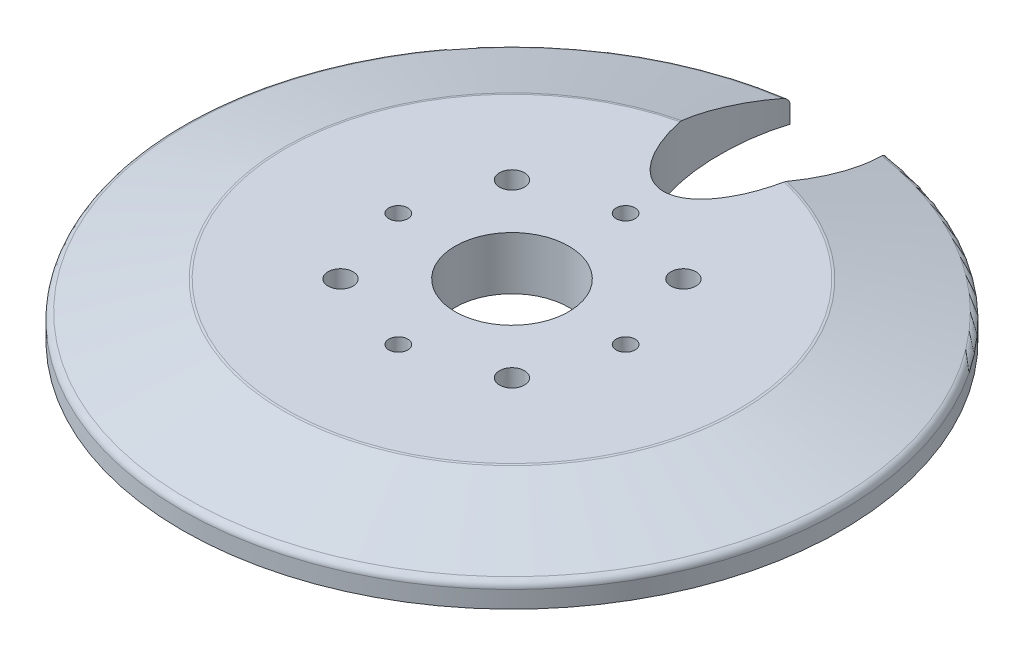
ISO-10303-21;
HEADER;
FILE_DESCRIPTION(('STEP AP214'),'2;1');
FILE_NAME('part.step','',(''),(''),'','','');
FILE_SCHEMA(('AUTOMOTIVE_DESIGN { 1 0 10303 214 1 1 1 1 }'));
ENDSEC;
DATA;
#1=APPLICATION_CONTEXT('core data for automotive mechanical design processes');
#2=APPLICATION_PROTOCOL_DEFINITION('international standard','automotive_design',2000,#1);
#3=PRODUCT_CONTEXT('',#1,'mechanical');
#4=PRODUCT('Part','Part','',(#3));
#5=PRODUCT_RELATED_PRODUCT_CATEGORY('part','',(#4));
#6=PRODUCT_DEFINITION_FORMATION('','',#4);
#7=PRODUCT_DEFINITION_CONTEXT('part definition',#1,'design');
#8=PRODUCT_DEFINITION('design','',#6,#7);
#9=PRODUCT_DEFINITION_SHAPE('','',#8);
#10=(LENGTH_UNIT() NAMED_UNIT(*) SI_UNIT(.MILLI.,.METRE.));
#11=(NAMED_UNIT(*) PLANE_ANGLE_UNIT() SI_UNIT($,.RADIAN.));
#12=(NAMED_UNIT(*) SI_UNIT($,.STERADIAN.) SOLID_ANGLE_UNIT());
#13=UNCERTAINTY_MEASURE_WITH_UNIT(LENGTH_MEASURE(1.E-05),#10,'distance_accuracy_value','');
#14=(GEOMETRIC_REPRESENTATION_CONTEXT(3) GLOBAL_UNCERTAINTY_ASSIGNED_CONTEXT((#13)) GLOBAL_UNIT_ASSIGNED_CONTEXT((#10,
#11,#12)) REPRESENTATION_CONTEXT('',''));
#15=CARTESIAN_POINT('',(0.,0.,0.));
#16=DIRECTION('',(0.,0.,1.));
#17=DIRECTION('',(1.,0.,0.));
#18=AXIS2_PLACEMENT_3D('',#15,#16,#17);
#19=CARTESIAN_POINT('',(0.,0.,0.));
#20=DIRECTION('',(0.,-1.,0.));
#21=DIRECTION('',(1.,0.,0.));
#22=AXIS2_PLACEMENT_3D('',#19,#20,#21);
#23=PLANE('',#22);
#24=CARTESIAN_POINT('',(-11.3137084989847,0.,-11.3137084989848));
#25=DIRECTION('',(0.,1.,0.));
#26=DIRECTION('',(0.,0.,1.));
#27=AXIS2_PLACEMENT_3D('',#24,#25,#26);
#28=CIRCLE('',#27,1.65);
#29=CARTESIAN_POINT('',(-11.3137084989847,0.,-9.66370849898478));
#30=VERTEX_POINT('',#29);
#31=EDGE_CURVE('E380',#30,#30,#28,.T.);
#32=ORIENTED_EDGE('',*,*,#31,.T.);
#33=EDGE_LOOP('',(#32));
#34=FACE_BOUND('',#33,.T.);
#35=CARTESIAN_POINT('',(11.3137084989848,0.,-11.3137084989847));
#36=DIRECTION('',(0.,1.,0.));
#37=DIRECTION('',(0.,0.,1.));
#38=AXIS2_PLACEMENT_3D('',#35,#36,#37);
#39=CIRCLE('',#38,1.65);
#40=CARTESIAN_POINT('',(11.3137084989848,0.,-9.6637084989847));
#41=VERTEX_POINT('',#40);
#42=EDGE_CURVE('E374',#41,#41,#39,.T.);
#43=ORIENTED_EDGE('',*,*,#42,.T.);
#44=EDGE_LOOP('',(#43));
#45=FACE_BOUND('',#44,.T.);
#46=CARTESIAN_POINT('',(11.3137084989847,0.,11.3137084989848));
#47=DIRECTION('',(0.,1.,0.));
#48=DIRECTION('',(0.,0.,1.));
#49=AXIS2_PLACEMENT_3D('',#46,#47,#48);
#50=CIRCLE('',#49,1.65);
#51=CARTESIAN_POINT('',(11.3137084989847,0.,12.9637084989848));
#52=VERTEX_POINT('',#51);
#53=EDGE_CURVE('E368',#52,#52,#50,.T.);
#54=ORIENTED_EDGE('',*,*,#53,.T.);
#55=EDGE_LOOP('',(#54));
#56=FACE_BOUND('',#55,.T.);
#57=CARTESIAN_POINT('',(-11.3137084989849,0.,11.3137084989846));
#58=DIRECTION('',(0.,1.,0.));
#59=DIRECTION('',(0.,0.,1.));
#60=AXIS2_PLACEMENT_3D('',#57,#58,#59);
#61=CIRCLE('',#60,1.65);
#62=CARTESIAN_POINT('',(-11.3137084989849,0.,12.9637084989846));
#63=VERTEX_POINT('',#62);
#64=EDGE_CURVE('E362',#63,#63,#61,.T.);
#65=ORIENTED_EDGE('',*,*,#64,.T.);
#66=EDGE_LOOP('',(#65));
#67=FACE_BOUND('',#66,.T.);
#68=CARTESIAN_POINT('',(0.,0.,-15.));
#69=DIRECTION('',(0.,1.,0.));
#70=DIRECTION('',(0.,0.,1.));
#71=AXIS2_PLACEMENT_3D('',#68,#69,#70);
#72=CIRCLE('',#71,1.25);
#73=CARTESIAN_POINT('',(0.,0.,-13.75));
#74=VERTEX_POINT('',#73);
#75=EDGE_CURVE('E356',#74,#74,#72,.T.);
#76=ORIENTED_EDGE('',*,*,#75,.T.);
#77=EDGE_LOOP('',(#76));
#78=FACE_BOUND('',#77,.T.);
#79=CARTESIAN_POINT('',(-15.,0.,0.));
#80=DIRECTION('',(0.,1.,0.));
#81=DIRECTION('',(0.,0.,1.));
#82=AXIS2_PLACEMENT_3D('',#79,#80,#81);
#83=CIRCLE('',#82,1.25);
#84=CARTESIAN_POINT('',(-15.,0.,1.25));
#85=VERTEX_POINT('',#84);
#86=EDGE_CURVE('E350',#85,#85,#83,.T.);
#87=ORIENTED_EDGE('',*,*,#86,.T.);
#88=EDGE_LOOP('',(#87));
#89=FACE_BOUND('',#88,.T.);
#90=CARTESIAN_POINT('',(0.,0.,15.));
#91=DIRECTION('',(0.,1.,0.));
#92=DIRECTION('',(0.,0.,1.));
#93=AXIS2_PLACEMENT_3D('',#90,#91,#92);
#94=CIRCLE('',#93,1.25);
#95=CARTESIAN_POINT('',(0.,0.,16.25));
#96=VERTEX_POINT('',#95);
#97=EDGE_CURVE('E343',#96,#96,#94,.T.);
#98=ORIENTED_EDGE('',*,*,#97,.T.);
#99=EDGE_LOOP('',(#98));
#100=FACE_BOUND('',#99,.T.);
#101=CARTESIAN_POINT('',(15.,0.,0.));
#102=DIRECTION('',(0.,1.,0.));
#103=DIRECTION('',(0.,0.,1.));
#104=AXIS2_PLACEMENT_3D('',#101,#102,#103);
#105=CIRCLE('',#104,1.25);
#106=CARTESIAN_POINT('',(15.,0.,1.25));
#107=VERTEX_POINT('',#106);
#108=EDGE_CURVE('E139',#107,#107,#105,.T.);
#109=ORIENTED_EDGE('',*,*,#108,.T.);
#110=EDGE_LOOP('',(#109));
#111=FACE_BOUND('',#110,.T.);
#112=CARTESIAN_POINT('',(0.,0.,-35.));
#113=DIRECTION('',(0.,1.,0.));
#114=DIRECTION('',(0.,0.,-1.));
#115=AXIS2_PLACEMENT_3D('',#112,#113,#114);
#116=ELLIPSE('',#115,15.,7.5);
#117=CARTESIAN_POINT('',(-6.33272240623717,0.,-43.0365731317625));
#118=VERTEX_POINT('',#117);
#119=CARTESIAN_POINT('',(6.33272240623717,0.,-43.0365731317625));
#120=VERTEX_POINT('',#119);
#121=EDGE_CURVE('E86',#118,#120,#116,.T.);
#122=ORIENTED_EDGE('',*,*,#121,.T.);
#123=CARTESIAN_POINT('',(0.,0.,0.));
#124=DIRECTION('',(0.,1.,0.));
#125=DIRECTION('',(-1.,0.,0.));
#126=AXIS2_PLACEMENT_3D('',#123,#124,#125);
#127=CIRCLE('',#126,43.5);
#128=EDGE_CURVE('E101',#118,#120,#127,.T.);
#129=ORIENTED_EDGE('',*,*,#128,.F.);
#130=EDGE_LOOP('',(#122,#129));
#131=FACE_BOUND('',#130,.T.);
#132=CARTESIAN_POINT('',(0.,0.,0.));
#133=DIRECTION('',(0.,1.,0.));
#134=DIRECTION('',(-1.,0.,0.));
#135=AXIS2_PLACEMENT_3D('',#132,#133,#134);
#136=CIRCLE('',#135,7.5);
#137=CARTESIAN_POINT('',(-7.5,0.,0.));
#138=VERTEX_POINT('',#137);
#139=EDGE_CURVE('E106',#138,#138,#136,.T.);
#140=ORIENTED_EDGE('',*,*,#139,.T.);
#141=EDGE_LOOP('',(#140));
#142=FACE_BOUND('',#141,.T.);
#143=ADVANCED_FACE('F38',(#34,#45,#56,#67,#78,#89,#100,#111,#131,#142),#23,.T.);
#144=CARTESIAN_POINT('',(0.,7.,0.));
#145=DIRECTION('',(0.,1.,0.));
#146=DIRECTION('',(-1.,0.,0.));
#147=AXIS2_PLACEMENT_3D('',#144,#145,#146);
#148=CYLINDRICAL_SURFACE('',#147,43.5);
#149=DIRECTION('',(0.,1.,0.));
#150=VECTOR('',#149,1.);
#151=CARTESIAN_POINT('',(6.33272240623717,0.,-43.0365731317625));
#152=LINE('',#151,#150);
#153=CARTESIAN_POINT('',(6.33272240623717,2.25332386367935,-43.0365731317625));
#154=VERTEX_POINT('',#153);
#155=EDGE_CURVE('E92',#154,#120,#152,.F.);
#156=ORIENTED_EDGE('',*,*,#155,.F.);
#157=CARTESIAN_POINT('',(0.,2.25332386367935,0.));
#158=DIRECTION('',(0.,-1.,0.));
#159=DIRECTION('',(1.,0.,0.));
#160=AXIS2_PLACEMENT_3D('',#157,#158,#159);
#161=CIRCLE('',#160,43.5);
#162=CARTESIAN_POINT('',(-6.33272240623717,2.25332386367935,-43.0365731317625));
#163=VERTEX_POINT('',#162);
#164=EDGE_CURVE('E11',#154,#163,#161,.T.);
#165=ORIENTED_EDGE('',*,*,#164,.T.);
#166=DIRECTION('',(0.,1.,0.));
#167=VECTOR('',#166,1.);
#168=CARTESIAN_POINT('',(-6.33272240623717,0.,-43.0365731317625));
#169=LINE('',#168,#167);
#170=EDGE_CURVE('E89',#118,#163,#169,.T.);
#171=ORIENTED_EDGE('',*,*,#170,.F.);
#172=ORIENTED_EDGE('',*,*,#128,.T.);
#173=EDGE_LOOP('',(#156,#165,#171,#172));
#174=FACE_BOUND('',#173,.T.);
#175=ADVANCED_FACE('F100',(#174),#148,.T.);
#176=CARTESIAN_POINT('',(0.,7.,0.));
#177=DIRECTION('',(0.,-1.,0.));
#178=DIRECTION('',(1.,0.,0.));
#179=AXIS2_PLACEMENT_3D('',#176,#177,#178);
#180=CONICAL_SURFACE('',#179,30.,1.28274087974427);
#181=CARTESIAN_POINT('',(6.91500357910958,7.,-29.1921689071042));
#182=CARTESIAN_POINT('',(6.99058252573705,6.89099283311108,-29.5523374989682));
#183=CARTESIAN_POINT('',(7.05832220949969,6.78205504266193,-29.9141349558623));
#184=CARTESIAN_POINT('',(7.17879527505233,6.56442602993237,-30.6403400157221));
#185=CARTESIAN_POINT('',(7.23152712439722,6.45573483395494,-31.0047478813439));
#186=CARTESIAN_POINT('',(7.32274027758913,6.23849407906337,-31.7362438260214));
#187=CARTESIAN_POINT('',(7.36119046320098,6.12994533704189,-32.103336001096));
#188=CARTESIAN_POINT('',(7.42409646655395,5.91330605808753,-32.8388817154343));
#189=CARTESIAN_POINT('',(7.44855110400736,5.80521556056259,-33.2073353668791));
#190=CARTESIAN_POINT('',(7.4837282666558,5.58954301157494,-33.9451865912305));
#191=CARTESIAN_POINT('',(7.49444598352582,5.48196115127079,-34.3145844493286));
#192=CARTESIAN_POINT('',(7.50222820836339,5.26741898212897,-35.0537093486207));
#193=CARTESIAN_POINT('',(7.49929214367075,5.1604586995496,-35.4234364029714));
#194=CARTESIAN_POINT('',(7.47346124470894,4.87895397970797,-36.3994969791757));
#195=CARTESIAN_POINT('',(7.43898934012312,4.70499260599332,-37.0057297173065));
#196=CARTESIAN_POINT('',(7.33211184178528,4.35944435080625,-38.2152165041845));
#197=CARTESIAN_POINT('',(7.25972761745695,4.18785618753007,-38.8184720378876));
#198=CARTESIAN_POINT('',(7.12008124714593,3.93117242596224,-39.7243714934751));
#199=CARTESIAN_POINT('',(7.06778068651763,3.84500804310769,-40.0290669225639));
#200=CARTESIAN_POINT('',(6.95223546193924,3.67351754913976,-40.6366064638285));
#201=CARTESIAN_POINT('',(6.8889915415212,3.58819138149091,-40.9394507003349));
#202=CARTESIAN_POINT('',(6.75088477541508,3.41839348516313,-41.543141048671));
#203=CARTESIAN_POINT('',(6.67600820260414,3.33392289318979,-41.8439843562068));
#204=CARTESIAN_POINT('',(6.51386216188534,3.16608619887389,-42.4426975121095));
#205=CARTESIAN_POINT('',(6.42658982091376,3.08272035749922,-42.740566653952));
#206=CARTESIAN_POINT('',(6.33272240623717,2.99999999999999,-43.0365731317625));
#207=B_SPLINE_CURVE_WITH_KNOTS('',3,(#181,#182,#183,#184,#185,#186,#187,#188,#189,#190,#191,
#192,#193,#194,#195,#196,#197,#198,#199,#200,#201,#202,#203,#204,#205,#206),.UNSPECIFIED.,.F.,
.F.,(4,2,2,2,2,2,2,2,2,2,2,2,4),(0.,1.15131888629253,2.30275529123953,3.45668603819832,
4.61071408535835,5.76514596595646,6.91962626560541,8.81340653585426,10.7061205165359,
11.668764326529,12.6313427566303,13.5950658292911,14.559012637163),.UNSPECIFIED.);
#208=CARTESIAN_POINT('',(6.94321339547094,6.95879811270839,-29.3283907945089));
#209=VERTEX_POINT('',#208);
#210=CARTESIAN_POINT('',(6.55788256942399,3.21212197638773,-42.2785097940843));
#211=VERTEX_POINT('',#210);
#212=EDGE_CURVE('E102',#209,#211,#207,.T.);
#213=ORIENTED_EDGE('',*,*,#212,.F.);
#214=CARTESIAN_POINT('',(0.,6.95879811270839,0.));
#215=DIRECTION('',(0.,1.,0.));
#216=DIRECTION('',(-1.,0.,0.));
#217=AXIS2_PLACEMENT_3D('',#214,#215,#216);
#218=CIRCLE('',#217,30.1390563696092);
#219=CARTESIAN_POINT('',(-6.94321339547094,6.95879811270839,-29.3283907945089));
#220=VERTEX_POINT('',#219);
#221=EDGE_CURVE('E47',#209,#220,#218,.F.);
#222=ORIENTED_EDGE('',*,*,#221,.T.);
#223=CARTESIAN_POINT('',(-6.33272240623717,2.99999999999999,-43.0365731317625));
#224=CARTESIAN_POINT('',(-6.41500963826579,3.07250474003001,-42.7771222068692));
#225=CARTESIAN_POINT('',(-6.4922183902949,3.14550824819237,-42.5162300383217));
#226=CARTESIAN_POINT('',(-6.63703185431277,3.29238350326354,-41.9920831626844));
#227=CARTESIAN_POINT('',(-6.70463820907837,3.36625509931295,-41.7288288679198));
#228=CARTESIAN_POINT('',(-6.83077906154359,3.51470502748615,-41.2005917470543));
#229=CARTESIAN_POINT('',(-6.88932049821938,3.58928277219832,-40.9356104065142));
#230=CARTESIAN_POINT('',(-6.99782566270411,3.73911487979075,-40.4040847401307));
#231=CARTESIAN_POINT('',(-7.04778895903325,3.81436927650632,-40.1375403363625));
#232=CARTESIAN_POINT('',(-7.18529740381263,4.04091747590818,-39.3364689220024));
#233=CARTESIAN_POINT('',(-7.26056724256861,4.19312301787461,-38.800052553725));
#234=CARTESIAN_POINT('',(-7.38041186706725,4.4995186820609,-37.7242805760132));
#235=CARTESIAN_POINT('',(-7.42497821436657,4.65370933801099,-37.1849241995758));
#236=CARTESIAN_POINT('',(-7.48453899730138,4.96367643654972,-36.1052408584844));
#237=CARTESIAN_POINT('',(-7.49954330617571,5.1194523322166,-35.5649142782289));
#238=CARTESIAN_POINT('',(-7.50043617800935,5.43236459982957,-34.4847031891015));
#239=CARTESIAN_POINT('',(-7.48632922062023,5.58950075875263,-33.9448186250011));
#240=CARTESIAN_POINT('',(-7.43860966826479,5.85078426938173,-33.0519327609483));
#241=CARTESIAN_POINT('',(-7.41335106375604,5.9546125671417,-32.6983718287059));
#242=CARTESIAN_POINT('',(-7.34989255637677,6.16269288852212,-31.9925273763884));
#243=CARTESIAN_POINT('',(-7.31169268836423,6.26694491100051,-31.6402438528751));
#244=CARTESIAN_POINT('',(-7.22194030171611,6.47586443492507,-30.9372196039325));
#245=CARTESIAN_POINT('',(-7.17037829609453,6.58053217932755,-30.5864801554503));
#246=CARTESIAN_POINT('',(-7.05330478479144,6.79011199480147,-29.8873790544799));
#247=CARTESIAN_POINT('',(-6.98779198783541,6.89502408759996,-29.5390176251819));
#248=CARTESIAN_POINT('',(-6.91500357910957,7.,-29.1921689071042));
#249=B_SPLINE_CURVE_WITH_KNOTS('',3,(#223,#224,#225,#226,#227,#228,#229,#230,#231,#232,#233,
#234,#235,#236,#237,#238,#239,#240,#241,#242,#243,#244,#245,#246,#247,#248),.UNSPECIFIED.,.F.,
.F.,(4,2,2,2,2,2,2,2,2,2,2,2,4),(0.,0.844945294848248,1.68974586200335,2.53389652337713,
3.37808963303341,5.06503674782468,6.75244731267445,8.43929421431119,10.1258815627279,
11.2337448023194,12.3416050578471,13.4502540485581,14.5590056996054),.UNSPECIFIED.);
#250=CARTESIAN_POINT('',(-6.55788256942399,3.21212197638773,-42.2785097940842));
#251=VERTEX_POINT('',#250);
#252=EDGE_CURVE('E96',#251,#220,#249,.T.);
#253=ORIENTED_EDGE('',*,*,#252,.F.);
#254=CARTESIAN_POINT('',(0.,3.21212197638774,0.));
#255=DIRECTION('',(0.,1.,0.));
#256=DIRECTION('',(-1.,0.,0.));
#257=AXIS2_PLACEMENT_3D('',#254,#255,#256);
#258=CIRCLE('',#257,42.7840883296914);
#259=EDGE_CURVE('E193',#251,#211,#258,.T.);
#260=ORIENTED_EDGE('',*,*,#259,.T.);
#261=EDGE_LOOP('',(#213,#222,#253,#260));
#262=FACE_BOUND('',#261,.T.);
#263=ADVANCED_FACE('F147',(#262),#180,.T.);
#264=CARTESIAN_POINT('',(-30.,7.,0.));
#265=DIRECTION('',(0.,1.,0.));
#266=DIRECTION('',(-1.,0.,0.));
#267=AXIS2_PLACEMENT_3D('',#264,#265,#266);
#268=PLANE('',#267);
#269=CARTESIAN_POINT('',(-11.3137084989847,7.,-11.3137084989848));
#270=DIRECTION('',(0.,1.,0.));
#271=DIRECTION('',(0.,0.,1.));
#272=AXIS2_PLACEMENT_3D('',#269,#270,#271);
#273=CIRCLE('',#272,1.64999999999999);
#274=CARTESIAN_POINT('',(-11.3137084989847,7.,-9.66370849898479));
#275=VERTEX_POINT('',#274);
#276=EDGE_CURVE('E382',#275,#275,#273,.T.);
#277=ORIENTED_EDGE('',*,*,#276,.F.);
#278=EDGE_LOOP('',(#277));
#279=FACE_BOUND('',#278,.T.);
#280=CARTESIAN_POINT('',(11.3137084989848,7.,-11.3137084989847));
#281=DIRECTION('',(0.,1.,0.));
#282=DIRECTION('',(0.,0.,1.));
#283=AXIS2_PLACEMENT_3D('',#280,#281,#282);
#284=CIRCLE('',#283,1.64999999999999);
#285=CARTESIAN_POINT('',(11.3137084989848,7.,-9.66370849898471));
#286=VERTEX_POINT('',#285);
#287=EDGE_CURVE('E377',#286,#286,#284,.T.);
#288=ORIENTED_EDGE('',*,*,#287,.F.);
#289=EDGE_LOOP('',(#288));
#290=FACE_BOUND('',#289,.T.);
#291=CARTESIAN_POINT('',(11.3137084989847,7.,11.3137084989848));
#292=DIRECTION('',(0.,1.,0.));
#293=DIRECTION('',(0.,0.,1.));
#294=AXIS2_PLACEMENT_3D('',#291,#292,#293);
#295=CIRCLE('',#294,1.64999999999999);
#296=CARTESIAN_POINT('',(11.3137084989847,7.,12.9637084989848));
#297=VERTEX_POINT('',#296);
#298=EDGE_CURVE('E371',#297,#297,#295,.T.);
#299=ORIENTED_EDGE('',*,*,#298,.F.);
#300=EDGE_LOOP('',(#299));
#301=FACE_BOUND('',#300,.T.);
#302=CARTESIAN_POINT('',(-11.3137084989849,7.,11.3137084989846));
#303=DIRECTION('',(0.,1.,0.));
#304=DIRECTION('',(0.,0.,1.));
#305=AXIS2_PLACEMENT_3D('',#302,#303,#304);
#306=CIRCLE('',#305,1.64999999999999);
#307=CARTESIAN_POINT('',(-11.3137084989849,7.,12.9637084989846));
#308=VERTEX_POINT('',#307);
#309=EDGE_CURVE('E365',#308,#308,#306,.T.);
#310=ORIENTED_EDGE('',*,*,#309,.F.);
#311=EDGE_LOOP('',(#310));
#312=FACE_BOUND('',#311,.T.);
#313=CARTESIAN_POINT('',(0.,7.,-15.));
#314=DIRECTION('',(0.,1.,0.));
#315=DIRECTION('',(0.,0.,1.));
#316=AXIS2_PLACEMENT_3D('',#313,#314,#315);
#317=CIRCLE('',#316,1.24999999999999);
#318=CARTESIAN_POINT('',(0.,7.,-13.75));
#319=VERTEX_POINT('',#318);
#320=EDGE_CURVE('E359',#319,#319,#317,.T.);
#321=ORIENTED_EDGE('',*,*,#320,.F.);
#322=EDGE_LOOP('',(#321));
#323=FACE_BOUND('',#322,.T.);
#324=CARTESIAN_POINT('',(-15.,7.,0.));
#325=DIRECTION('',(0.,1.,0.));
#326=DIRECTION('',(0.,0.,1.));
#327=AXIS2_PLACEMENT_3D('',#324,#325,#326);
#328=CIRCLE('',#327,1.24999999999999);
#329=CARTESIAN_POINT('',(-15.,7.,1.24999999999999));
#330=VERTEX_POINT('',#329);
#331=EDGE_CURVE('E353',#330,#330,#328,.T.);
#332=ORIENTED_EDGE('',*,*,#331,.F.);
#333=EDGE_LOOP('',(#332));
#334=FACE_BOUND('',#333,.T.);
#335=CARTESIAN_POINT('',(0.,7.,15.));
#336=DIRECTION('',(0.,1.,0.));
#337=DIRECTION('',(0.,0.,1.));
#338=AXIS2_PLACEMENT_3D('',#335,#336,#337);
#339=CIRCLE('',#338,1.24999999999999);
#340=CARTESIAN_POINT('',(0.,7.,16.25));
#341=VERTEX_POINT('',#340);
#342=EDGE_CURVE('E345',#341,#341,#339,.T.);
#343=ORIENTED_EDGE('',*,*,#342,.F.);
#344=EDGE_LOOP('',(#343));
#345=FACE_BOUND('',#344,.T.);
#346=CARTESIAN_POINT('',(15.,7.,0.));
#347=DIRECTION('',(0.,1.,0.));
#348=DIRECTION('',(0.,0.,1.));
#349=AXIS2_PLACEMENT_3D('',#346,#347,#348);
#350=CIRCLE('',#349,1.24999999999999);
#351=CARTESIAN_POINT('',(15.,7.,1.24999999999999));
#352=VERTEX_POINT('',#351);
#353=EDGE_CURVE('E341',#352,#352,#350,.T.);
#354=ORIENTED_EDGE('',*,*,#353,.F.);
#355=EDGE_LOOP('',(#354));
#356=FACE_BOUND('',#355,.T.);
#357=CARTESIAN_POINT('',(0.,7.,-35.));
#358=DIRECTION('',(0.,1.,0.));
#359=DIRECTION('',(0.,0.,-1.));
#360=AXIS2_PLACEMENT_3D('',#357,#358,#359);
#361=ELLIPSE('',#360,15.,7.5);
#362=CARTESIAN_POINT('',(-6.88478139297233,7.,-29.0502823021653));
#363=VERTEX_POINT('',#362);
#364=CARTESIAN_POINT('',(6.88478139297233,7.,-29.0502823021653));
#365=VERTEX_POINT('',#364);
#366=EDGE_CURVE('E97',#363,#365,#361,.T.);
#367=ORIENTED_EDGE('',*,*,#366,.F.);
#368=CARTESIAN_POINT('',(0.,7.,0.));
#369=DIRECTION('',(0.,1.,0.));
#370=DIRECTION('',(-1.,0.,0.));
#371=AXIS2_PLACEMENT_3D('',#368,#369,#370);
#372=CIRCLE('',#371,29.8549680399178);
#373=EDGE_CURVE('E105',#363,#365,#372,.T.);
#374=ORIENTED_EDGE('',*,*,#373,.T.);
#375=EDGE_LOOP('',(#367,#374));
#376=FACE_BOUND('',#375,.T.);
#377=CARTESIAN_POINT('',(0.,7.,0.));
#378=DIRECTION('',(0.,1.,0.));
#379=DIRECTION('',(-1.,0.,0.));
#380=AXIS2_PLACEMENT_3D('',#377,#378,#379);
#381=CIRCLE('',#380,7.5);
#382=CARTESIAN_POINT('',(-7.5,7.,0.));
#383=VERTEX_POINT('',#382);
#384=EDGE_CURVE('E112',#383,#383,#381,.T.);
#385=ORIENTED_EDGE('',*,*,#384,.F.);
#386=EDGE_LOOP('',(#385));
#387=FACE_BOUND('',#386,.T.);
#388=ADVANCED_FACE('F151',(#279,#290,#301,#312,#323,#334,#345,#356,#376,#387),#268,.T.);
#389=CARTESIAN_POINT('',(0.,0.,0.));
#390=DIRECTION('',(0.,1.,0.));
#391=DIRECTION('',(-1.,0.,0.));
#392=AXIS2_PLACEMENT_3D('',#389,#390,#391);
#393=CYLINDRICAL_SURFACE('',#392,7.5);
#394=ORIENTED_EDGE('',*,*,#139,.F.);
#395=EDGE_LOOP('',(#394));
#396=FACE_BOUND('',#395,.T.);
#397=ORIENTED_EDGE('',*,*,#384,.T.);
#398=EDGE_LOOP('',(#397));
#399=FACE_BOUND('',#398,.T.);
#400=ADVANCED_FACE('F130',(#396,#399),#393,.F.);
#401=DIRECTION('',(0.,1.,0.));
#402=VECTOR('',#401,1.);
#403=SURFACE_OF_LINEAR_EXTRUSION('',#116,#402);
#404=ORIENTED_EDGE('',*,*,#366,.T.);
#405=CARTESIAN_POINT('',(6.88478139297233,7.,-29.0502823021653));
#406=CARTESIAN_POINT('',(6.8949862514856,6.9999634049701,-29.0975476928927));
#407=CARTESIAN_POINT('',(6.90495801428378,6.99651161684752,-29.1443560959517));
#408=CARTESIAN_POINT('',(6.92443534844999,6.98277765441698,-29.2370589267329));
#409=CARTESIAN_POINT('',(6.93394091981801,6.97249548010903,-29.2829533544551));
#410=CARTESIAN_POINT('',(6.94321339547094,6.95879811270839,-29.3283907945089));
#411=B_SPLINE_CURVE_WITH_KNOTS('',3,(#405,#406,#407,#408,#409,#410),.UNSPECIFIED.,.F.,.F.,(4,2,
4),(0.,0.143949287679112,0.287898575358226),.UNSPECIFIED.);
#412=EDGE_CURVE('E62',#365,#209,#411,.T.);
#413=ORIENTED_EDGE('',*,*,#412,.T.);
#414=ORIENTED_EDGE('',*,*,#212,.T.);
#415=CARTESIAN_POINT('',(6.55788256942399,3.21212197638773,-42.2785097940843));
#416=CARTESIAN_POINT('',(6.54145223153811,3.19554891088319,-42.337758300335));
#417=CARTESIAN_POINT('',(6.52510867427378,3.17395489804709,-42.3956801296065));
#418=CARTESIAN_POINT('',(6.49312395434802,3.12108517265067,-42.5074227671952));
#419=CARTESIAN_POINT('',(6.47748582130521,3.08977155247155,-42.5612264718793));
#420=CARTESIAN_POINT('',(6.44754869915072,3.01788583651044,-42.6628968444487));
#421=CARTESIAN_POINT('',(6.43325258000283,2.97729450881321,-42.7107508564296));
#422=CARTESIAN_POINT('',(6.40675606569529,2.88776494684997,-42.7984951577722));
#423=CARTESIAN_POINT('',(6.3945524032793,2.83883996773047,-42.8383978787352));
#424=CARTESIAN_POINT('',(6.373709490064,2.73758958544038,-42.9059966713853));
#425=CARTESIAN_POINT('',(6.36487982992879,2.68574581847274,-42.9343541772473));
#426=CARTESIAN_POINT('',(6.35020223278296,2.57741516975569,-42.9812593054718));
#427=CARTESIAN_POINT('',(6.34435043780579,2.52093440625962,-42.9998196217306));
#428=CARTESIAN_POINT('',(6.33772511307492,2.42880346549657,-43.020788363379));
#429=CARTESIAN_POINT('',(6.33585457891816,2.39399212836126,-43.026694436822));
#430=CARTESIAN_POINT('',(6.33335161747377,2.3239035381399,-43.034589989668));
#431=CARTESIAN_POINT('',(6.33271854270558,2.28862653843768,-43.0365815172967));
#432=CARTESIAN_POINT('',(6.33272240623641,2.25332386368044,-43.0365731317707));
#433=B_SPLINE_CURVE_WITH_KNOTS('',3,(#415,#416,#417,#418,#419,#420,#421,#422,#423,#424,#425,
#426,#427,#428,#429,#430,#431,#432),.UNSPECIFIED.,.F.,.F.,(4,2,2,2,2,2,2,2,4),(0.,
0.190911146109986,0.382576427888591,0.574642678207329,0.766406241135641,0.944674004844465,
1.12271022238328,1.22856347081394,1.33436131840591),.UNSPECIFIED.);
#434=EDGE_CURVE('E54',#211,#154,#433,.T.);
#435=ORIENTED_EDGE('',*,*,#434,.T.);
#436=ORIENTED_EDGE('',*,*,#155,.T.);
#437=ORIENTED_EDGE('',*,*,#121,.F.);
#438=ORIENTED_EDGE('',*,*,#170,.T.);
#439=CARTESIAN_POINT('',(-6.33272240623717,2.25332386367935,-43.0365731317625));
#440=CARTESIAN_POINT('',(-6.33272168260184,2.27946902694007,-43.0365743962767));
#441=CARTESIAN_POINT('',(-6.33306760273184,2.30560076958579,-43.0354851896686));
#442=CARTESIAN_POINT('',(-6.33444242300281,2.35765858180769,-43.031149772077));
#443=CARTESIAN_POINT('',(-6.3354711110225,2.38358471273228,-43.0279042310198));
#444=CARTESIAN_POINT('',(-6.33955497803969,2.46059935771401,-43.015003421905));
#445=CARTESIAN_POINT('',(-6.34360814439909,2.51114182950717,-43.0021835183904));
#446=CARTESIAN_POINT('',(-6.35414418660437,2.60919717976521,-42.9686756623013));
#447=CARTESIAN_POINT('',(-6.36062563800879,2.6567118152882,-42.9479923223444));
#448=CARTESIAN_POINT('',(-6.37568469092177,2.74764758806194,-42.8995815241004));
#449=CARTESIAN_POINT('',(-6.38426295827488,2.79106741892468,-42.8718518281298));
#450=CARTESIAN_POINT('',(-6.40353225002038,2.87467050996518,-42.809002006711));
#451=CARTESIAN_POINT('',(-6.4142978871377,2.91463620699512,-42.773616728488));
#452=CARTESIAN_POINT('',(-6.43725651879826,2.98848147147487,-42.6973301529732));
#453=CARTESIAN_POINT('',(-6.44945062255256,3.02235625687064,-42.6564245653381));
#454=CARTESIAN_POINT('',(-6.46963735844687,3.07098040689436,-42.5878882629307));
#455=CARTESIAN_POINT('',(-6.47731097987219,3.08788906984938,-42.5616623587254));
#456=CARTESIAN_POINT('',(-6.49291989227107,3.11931516814045,-42.5079243807097));
#457=CARTESIAN_POINT('',(-6.50085488179079,3.13383524995952,-42.4804137743176));
#458=CARTESIAN_POINT('',(-6.51690273778873,3.16041872338207,-42.4243487612388));
#459=CARTESIAN_POINT('',(-6.52501525662213,3.17248651043796,-42.395796332252));
#460=CARTESIAN_POINT('',(-6.54137016195438,3.194163876225,-42.3377805717855));
#461=CARTESIAN_POINT('',(-6.5496126479619,3.2037714635621,-42.3083165238856));
#462=CARTESIAN_POINT('',(-6.55788256942398,3.21212197638773,-42.2785097940843));
#463=B_SPLINE_CURVE_WITH_KNOTS('',3,(#439,#440,#441,#442,#443,#444,#445,#446,#447,#448,#449,
#450,#451,#452,#453,#454,#455,#456,#457,#458,#459,#460,#461,#462),.UNSPECIFIED.,.F.,.F.,(4,2,2,
2,2,2,2,2,2,2,2,4),(0.,0.0783843172779866,0.156744293627828,0.312819928876417,0.468804152536854,
0.624837973532716,0.787538811060687,0.950366834620263,1.04666677158064,1.14285928151204,
1.23887782654586,1.33497384927565),.UNSPECIFIED.);
#464=EDGE_CURVE('E109',#163,#251,#463,.T.);
#465=ORIENTED_EDGE('',*,*,#464,.T.);
#466=ORIENTED_EDGE('',*,*,#252,.T.);
#467=CARTESIAN_POINT('',(-6.94321339547094,6.95879811270839,-29.3283907945089));
#468=CARTESIAN_POINT('',(-6.933940919818,6.97249548010903,-29.2829533544551));
#469=CARTESIAN_POINT('',(-6.92443534844999,6.98277765441698,-29.2370589267329));
#470=CARTESIAN_POINT('',(-6.90495801428378,6.99651161684752,-29.1443560959517));
#471=CARTESIAN_POINT('',(-6.8949862514856,6.9999634049701,-29.0975476928927));
#472=CARTESIAN_POINT('',(-6.88478139297233,7.,-29.0502823021653));
#473=B_SPLINE_CURVE_WITH_KNOTS('',3,(#467,#468,#469,#470,#471,#472),.UNSPECIFIED.,.F.,.F.,(4,2,
4),(0.,0.143949287679111,0.287898575358216),.UNSPECIFIED.);
#474=EDGE_CURVE('E184',#220,#363,#473,.T.);
#475=ORIENTED_EDGE('',*,*,#474,.T.);
#476=EDGE_LOOP('',(#404,#413,#414,#435,#436,#437,#438,#465,#466,#475));
#477=FACE_BOUND('',#476,.T.);
#478=ADVANCED_FACE('F88',(#477),#403,.F.);
#479=CARTESIAN_POINT('',(15.,7.,0.));
#480=DIRECTION('',(0.,1.,0.));
#481=DIRECTION('',(0.,0.,1.));
#482=AXIS2_PLACEMENT_3D('',#479,#480,#481);
#483=CYLINDRICAL_SURFACE('',#482,1.24999999999999);
#484=ORIENTED_EDGE('',*,*,#108,.F.);
#485=EDGE_LOOP('',(#484));
#486=FACE_BOUND('',#485,.T.);
#487=ORIENTED_EDGE('',*,*,#353,.T.);
#488=EDGE_LOOP('',(#487));
#489=FACE_BOUND('',#488,.T.);
#490=ADVANCED_FACE('F129',(#486,#489),#483,.F.);
#491=CARTESIAN_POINT('',(0.,7.,15.));
#492=DIRECTION('',(0.,1.,0.));
#493=DIRECTION('',(0.,0.,1.));
#494=AXIS2_PLACEMENT_3D('',#491,#492,#493);
#495=CYLINDRICAL_SURFACE('',#494,1.24999999999999);
#496=ORIENTED_EDGE('',*,*,#97,.F.);
#497=EDGE_LOOP('',(#496));
#498=FACE_BOUND('',#497,.T.);
#499=ORIENTED_EDGE('',*,*,#342,.T.);
#500=EDGE_LOOP('',(#499));
#501=FACE_BOUND('',#500,.T.);
#502=ADVANCED_FACE('F253',(#498,#501),#495,.F.);
#503=CARTESIAN_POINT('',(-15.,7.,0.));
#504=DIRECTION('',(0.,1.,0.));
#505=DIRECTION('',(0.,0.,1.));
#506=AXIS2_PLACEMENT_3D('',#503,#504,#505);
#507=CYLINDRICAL_SURFACE('',#506,1.24999999999999);
#508=ORIENTED_EDGE('',*,*,#86,.F.);
#509=EDGE_LOOP('',(#508));
#510=FACE_BOUND('',#509,.T.);
#511=ORIENTED_EDGE('',*,*,#331,.T.);
#512=EDGE_LOOP('',(#511));
#513=FACE_BOUND('',#512,.T.);
#514=ADVANCED_FACE('F245',(#510,#513),#507,.F.);
#515=CARTESIAN_POINT('',(0.,7.,-15.));
#516=DIRECTION('',(0.,1.,0.));
#517=DIRECTION('',(0.,0.,1.));
#518=AXIS2_PLACEMENT_3D('',#515,#516,#517);
#519=CYLINDRICAL_SURFACE('',#518,1.24999999999999);
#520=ORIENTED_EDGE('',*,*,#75,.F.);
#521=EDGE_LOOP('',(#520));
#522=FACE_BOUND('',#521,.T.);
#523=ORIENTED_EDGE('',*,*,#320,.T.);
#524=EDGE_LOOP('',(#523));
#525=FACE_BOUND('',#524,.T.);
#526=ADVANCED_FACE('F237',(#522,#525),#519,.F.);
#527=CARTESIAN_POINT('',(-11.3137084989849,7.,11.3137084989846));
#528=DIRECTION('',(0.,1.,0.));
#529=DIRECTION('',(0.,0.,1.));
#530=AXIS2_PLACEMENT_3D('',#527,#528,#529);
#531=CYLINDRICAL_SURFACE('',#530,1.64999999999999);
#532=ORIENTED_EDGE('',*,*,#64,.F.);
#533=EDGE_LOOP('',(#532));
#534=FACE_BOUND('',#533,.T.);
#535=ORIENTED_EDGE('',*,*,#309,.T.);
#536=EDGE_LOOP('',(#535));
#537=FACE_BOUND('',#536,.T.);
#538=ADVANCED_FACE('F229',(#534,#537),#531,.F.);
#539=CARTESIAN_POINT('',(11.3137084989847,7.,11.3137084989848));
#540=DIRECTION('',(0.,1.,0.));
#541=DIRECTION('',(0.,0.,1.));
#542=AXIS2_PLACEMENT_3D('',#539,#540,#541);
#543=CYLINDRICAL_SURFACE('',#542,1.64999999999999);
#544=ORIENTED_EDGE('',*,*,#53,.F.);
#545=EDGE_LOOP('',(#544));
#546=FACE_BOUND('',#545,.T.);
#547=ORIENTED_EDGE('',*,*,#298,.T.);
#548=EDGE_LOOP('',(#547));
#549=FACE_BOUND('',#548,.T.);
#550=ADVANCED_FACE('F221',(#546,#549),#543,.F.);
#551=CARTESIAN_POINT('',(11.3137084989848,7.,-11.3137084989847));
#552=DIRECTION('',(0.,1.,0.));
#553=DIRECTION('',(0.,0.,1.));
#554=AXIS2_PLACEMENT_3D('',#551,#552,#553);
#555=CYLINDRICAL_SURFACE('',#554,1.64999999999999);
#556=ORIENTED_EDGE('',*,*,#42,.F.);
#557=EDGE_LOOP('',(#556));
#558=FACE_BOUND('',#557,.T.);
#559=ORIENTED_EDGE('',*,*,#287,.T.);
#560=EDGE_LOOP('',(#559));
#561=FACE_BOUND('',#560,.T.);
#562=ADVANCED_FACE('F213',(#558,#561),#555,.F.);
#563=CARTESIAN_POINT('',(-11.3137084989847,7.,-11.3137084989848));
#564=DIRECTION('',(0.,1.,0.));
#565=DIRECTION('',(0.,0.,1.));
#566=AXIS2_PLACEMENT_3D('',#563,#564,#565);
#567=CYLINDRICAL_SURFACE('',#566,1.64999999999999);
#568=ORIENTED_EDGE('',*,*,#31,.F.);
#569=EDGE_LOOP('',(#568));
#570=FACE_BOUND('',#569,.T.);
#571=ORIENTED_EDGE('',*,*,#276,.T.);
#572=EDGE_LOOP('',(#571));
#573=FACE_BOUND('',#572,.T.);
#574=ADVANCED_FACE('F181',(#570,#573),#567,.F.);
#575=CARTESIAN_POINT('',(0.,6.,0.));
#576=DIRECTION('',(0.,1.,0.));
#577=DIRECTION('',(-1.,0.,0.));
#578=AXIS2_PLACEMENT_3D('',#575,#576,#577);
#579=TOROIDAL_SURFACE('',#578,29.8549680399178,1.);
#580=ORIENTED_EDGE('',*,*,#474,.F.);
#581=ORIENTED_EDGE('',*,*,#221,.F.);
#582=ORIENTED_EDGE('',*,*,#412,.F.);
#583=ORIENTED_EDGE('',*,*,#373,.F.);
#584=EDGE_LOOP('',(#580,#581,#582,#583));
#585=FACE_BOUND('',#584,.T.);
#586=ADVANCED_FACE('F178',(#585),#579,.T.);
#587=CARTESIAN_POINT('',(0.,2.25332386367935,0.));
#588=DIRECTION('',(0.,-1.,0.));
#589=DIRECTION('',(1.,0.,0.));
#590=AXIS2_PLACEMENT_3D('',#587,#588,#589);
#591=TOROIDAL_SURFACE('',#590,42.5,1.);
#592=ORIENTED_EDGE('',*,*,#464,.F.);
#593=ORIENTED_EDGE('',*,*,#164,.F.);
#594=ORIENTED_EDGE('',*,*,#434,.F.);
#595=ORIENTED_EDGE('',*,*,#259,.F.);
#596=EDGE_LOOP('',(#592,#593,#594,#595));
#597=FACE_BOUND('',#596,.T.);
#598=ADVANCED_FACE('F40',(#597),#591,.T.);
#599=CLOSED_SHELL('',(#143,#175,#263,#388,#400,#478,#490,#502,#514,#526,#538,#550,#562,#574,
#586,#598));
#600=MANIFOLD_SOLID_BREP('B2',#599);
#601=ADVANCED_BREP_SHAPE_REPRESENTATION('',(#18,#600),#14);
#602=SHAPE_DEFINITION_REPRESENTATION(#9,#601);
ENDSEC;
END-ISO-10303-21;
